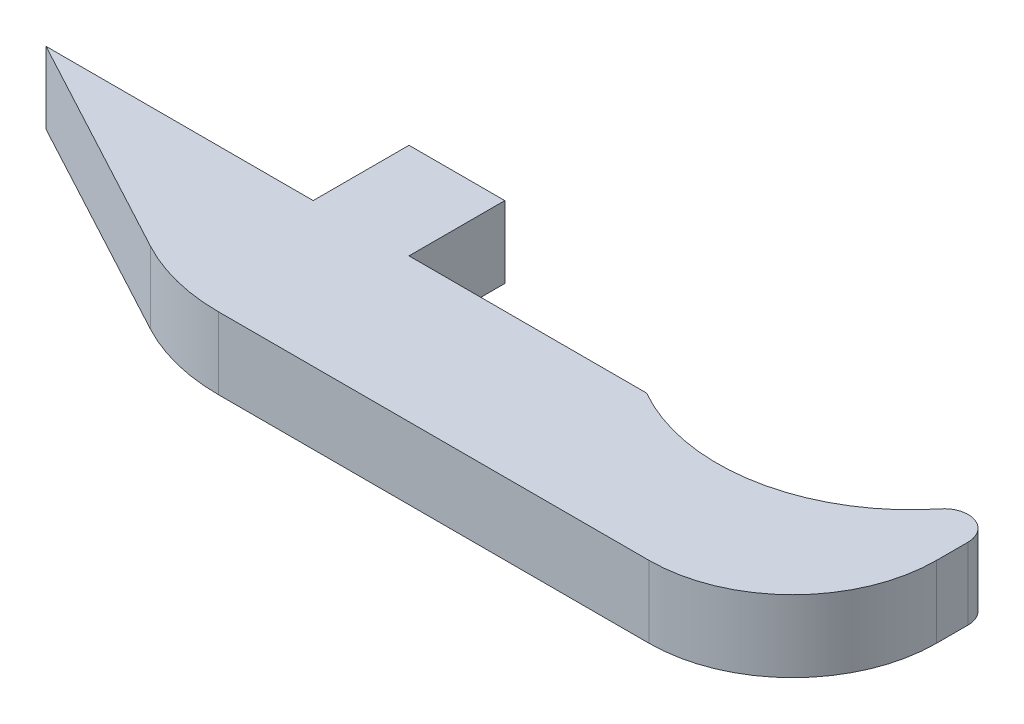
ISO-10303-21;
HEADER;
FILE_DESCRIPTION(('STEP AP214'),'2;1');
FILE_NAME('part.step','',(''),(''),'','','');
FILE_SCHEMA(('AUTOMOTIVE_DESIGN { 1 0 10303 214 1 1 1 1 }'));
ENDSEC;
DATA;
#1=APPLICATION_CONTEXT('core data for automotive mechanical design processes');
#2=APPLICATION_PROTOCOL_DEFINITION('international standard','automotive_design',2000,#1);
#3=PRODUCT_CONTEXT('',#1,'mechanical');
#4=PRODUCT('Part','Part','',(#3));
#5=PRODUCT_RELATED_PRODUCT_CATEGORY('part','',(#4));
#6=PRODUCT_DEFINITION_FORMATION('','',#4);
#7=PRODUCT_DEFINITION_CONTEXT('part definition',#1,'design');
#8=PRODUCT_DEFINITION('design','',#6,#7);
#9=PRODUCT_DEFINITION_SHAPE('','',#8);
#10=(LENGTH_UNIT() NAMED_UNIT(*) SI_UNIT(.MILLI.,.METRE.));
#11=(NAMED_UNIT(*) PLANE_ANGLE_UNIT() SI_UNIT($,.RADIAN.));
#12=(NAMED_UNIT(*) SI_UNIT($,.STERADIAN.) SOLID_ANGLE_UNIT());
#13=UNCERTAINTY_MEASURE_WITH_UNIT(LENGTH_MEASURE(1.E-05),#10,'distance_accuracy_value','');
#14=(GEOMETRIC_REPRESENTATION_CONTEXT(3) GLOBAL_UNCERTAINTY_ASSIGNED_CONTEXT((#13)) GLOBAL_UNIT_ASSIGNED_CONTEXT((#10,
#11,#12)) REPRESENTATION_CONTEXT('',''));
#15=CARTESIAN_POINT('',(0.,0.,0.));
#16=DIRECTION('',(0.,0.,1.));
#17=DIRECTION('',(1.,0.,0.));
#18=AXIS2_PLACEMENT_3D('',#15,#16,#17);
#19=CARTESIAN_POINT('',(0.,4.7625,0.));
#20=DIRECTION('',(0.,0.,1.));
#21=DIRECTION('',(1.,0.,0.));
#22=AXIS2_PLACEMENT_3D('',#19,#20,#21);
#23=PLANE('',#22);
#24=DIRECTION('',(-1.,0.,0.));
#25=VECTOR('',#24,1.);
#26=CARTESIAN_POINT('',(0.,0.,0.));
#27=LINE('',#26,#25);
#28=CARTESIAN_POINT('',(42.9930989263059,0.,0.));
#29=VERTEX_POINT('',#28);
#30=CARTESIAN_POINT('',(27.2395000000001,0.,0.));
#31=VERTEX_POINT('',#30);
#32=EDGE_CURVE('E177',#29,#31,#27,.T.);
#33=ORIENTED_EDGE('',*,*,#32,.T.);
#34=DIRECTION('',(0.,-1.,0.));
#35=VECTOR('',#34,1.);
#36=CARTESIAN_POINT('',(27.2395000000001,4.7625,0.));
#37=LINE('',#36,#35);
#38=CARTESIAN_POINT('',(27.2395000000001,4.7625,0.));
#39=VERTEX_POINT('',#38);
#40=EDGE_CURVE('E58',#39,#31,#37,.T.);
#41=ORIENTED_EDGE('',*,*,#40,.F.);
#42=DIRECTION('',(-1.,0.,0.));
#43=VECTOR('',#42,1.);
#44=CARTESIAN_POINT('',(0.,4.7625,0.));
#45=LINE('',#44,#43);
#46=CARTESIAN_POINT('',(42.9930989263059,4.7625,0.));
#47=VERTEX_POINT('',#46);
#48=EDGE_CURVE('E165',#47,#39,#45,.T.);
#49=ORIENTED_EDGE('',*,*,#48,.F.);
#50=DIRECTION('',(0.,-1.,0.));
#51=VECTOR('',#50,1.);
#52=CARTESIAN_POINT('',(42.9930989263059,4.7625,0.));
#53=LINE('',#52,#51);
#54=EDGE_CURVE('E187',#47,#29,#53,.T.);
#55=ORIENTED_EDGE('',*,*,#54,.T.);
#56=EDGE_LOOP('',(#33,#41,#49,#55));
#57=FACE_BOUND('',#56,.T.);
#58=ADVANCED_FACE('F35',(#57),#23,.F.);
#59=CARTESIAN_POINT('',(49.3775999999999,4.7625,-11.1252));
#60=DIRECTION('',(0.,-1.,0.));
#61=DIRECTION('',(0.,0.,-1.));
#62=AXIS2_PLACEMENT_3D('',#59,#60,#61);
#63=CYLINDRICAL_SURFACE('',#62,12.827);
#64=CARTESIAN_POINT('',(49.3775999999999,4.7625,-11.1252));
#65=DIRECTION('',(0.,1.,0.));
#66=DIRECTION('',(0.,0.,1.));
#67=AXIS2_PLACEMENT_3D('',#64,#65,#66);
#68=CIRCLE('',#67,12.827);
#69=CARTESIAN_POINT('',(59.3792696035242,4.7625,-3.09410205875065));
#70=VERTEX_POINT('',#69);
#71=EDGE_CURVE('E161',#47,#70,#68,.T.);
#72=ORIENTED_EDGE('',*,*,#71,.T.);
#73=DIRECTION('',(0.,-1.,0.));
#74=VECTOR('',#73,1.);
#75=CARTESIAN_POINT('',(59.3792696035242,4.7625,-3.09410205875065));
#76=LINE('',#75,#74);
#77=CARTESIAN_POINT('',(59.3792696035242,0.,-3.09410205875065));
#78=VERTEX_POINT('',#77);
#79=EDGE_CURVE('E201',#70,#78,#76,.T.);
#80=ORIENTED_EDGE('',*,*,#79,.T.);
#81=CARTESIAN_POINT('',(49.3775999999999,0.,-11.1252));
#82=DIRECTION('',(0.,1.,0.));
#83=DIRECTION('',(0.,0.,1.));
#84=AXIS2_PLACEMENT_3D('',#81,#82,#83);
#85=CIRCLE('',#84,12.827);
#86=EDGE_CURVE('E158',#29,#78,#85,.T.);
#87=ORIENTED_EDGE('',*,*,#86,.F.);
#88=ORIENTED_EDGE('',*,*,#54,.F.);
#89=EDGE_LOOP('',(#72,#80,#87,#88));
#90=FACE_BOUND('',#89,.T.);
#91=ADVANCED_FACE('F245',(#90),#63,.F.);
#92=CARTESIAN_POINT('',(20.8895000000001,4.7625,0.));
#93=VERTEX_POINT('',#92);
#94=CARTESIAN_POINT('',(3.17499999999972,4.7625,0.));
#95=VERTEX_POINT('',#94);
#96=EDGE_CURVE('E50',#93,#95,#45,.T.);
#97=ORIENTED_EDGE('',*,*,#96,.F.);
#98=DIRECTION('',(0.,-1.,0.));
#99=VECTOR('',#98,1.);
#100=CARTESIAN_POINT('',(20.8895000000001,4.7625,0.));
#101=LINE('',#100,#99);
#102=CARTESIAN_POINT('',(20.8895000000001,0.,0.));
#103=VERTEX_POINT('',#102);
#104=EDGE_CURVE('E145',#93,#103,#101,.T.);
#105=ORIENTED_EDGE('',*,*,#104,.T.);
#106=CARTESIAN_POINT('',(3.17499999999972,0.,0.));
#107=VERTEX_POINT('',#106);
#108=EDGE_CURVE('E176',#103,#107,#27,.T.);
#109=ORIENTED_EDGE('',*,*,#108,.T.);
#110=DIRECTION('',(0.,-1.,0.));
#111=VECTOR('',#110,1.);
#112=CARTESIAN_POINT('',(3.17499999999972,4.7625,0.));
#113=LINE('',#112,#111);
#114=EDGE_CURVE('E173',#95,#107,#113,.T.);
#115=ORIENTED_EDGE('',*,*,#114,.F.);
#116=EDGE_LOOP('',(#97,#105,#109,#115));
#117=FACE_BOUND('',#116,.T.);
#118=ADVANCED_FACE('F250',(#117),#23,.F.);
#119=CARTESIAN_POINT('',(0.709577123322862,4.7625,-1.32265175787383));
#120=DIRECTION('',(0.472746081675464,0.,-0.881198696243075));
#121=DIRECTION('',(-0.881198696243075,0.,-0.472746081675464));
#122=AXIS2_PLACEMENT_3D('',#119,#120,#121);
#123=PLANE('',#122);
#124=DIRECTION('',(0.881198696243075,0.,0.472746081675464));
#125=VECTOR('',#124,1.);
#126=CARTESIAN_POINT('',(0.709577123322862,0.,-1.32265175787383));
#127=LINE('',#126,#125);
#128=CARTESIAN_POINT('',(18.117240496423,0.,8.01622344228706));
#129=VERTEX_POINT('',#128);
#130=EDGE_CURVE('E179',#107,#129,#127,.T.);
#131=ORIENTED_EDGE('',*,*,#130,.T.);
#132=DIRECTION('',(0.,-1.,0.));
#133=VECTOR('',#132,1.);
#134=CARTESIAN_POINT('',(18.117240496423,4.7625,8.01622344228706));
#135=LINE('',#134,#133);
#136=CARTESIAN_POINT('',(18.117240496423,4.7625,8.01622344228706));
#137=VERTEX_POINT('',#136);
#138=EDGE_CURVE('E43',#129,#137,#135,.F.);
#139=ORIENTED_EDGE('',*,*,#138,.T.);
#140=DIRECTION('',(0.881198696243075,0.,0.472746081675464));
#141=VECTOR('',#140,1.);
#142=CARTESIAN_POINT('',(0.709577123322862,4.7625,-1.32265175787383));
#143=LINE('',#142,#141);
#144=EDGE_CURVE('E167',#95,#137,#143,.T.);
#145=ORIENTED_EDGE('',*,*,#144,.F.);
#146=ORIENTED_EDGE('',*,*,#114,.T.);
#147=EDGE_LOOP('',(#131,#139,#145,#146));
#148=FACE_BOUND('',#147,.T.);
#149=ADVANCED_FACE('F217',(#148),#123,.F.);
#150=CARTESIAN_POINT('',(0.,4.7625,9.525));
#151=DIRECTION('',(0.,0.,-1.));
#152=DIRECTION('',(-1.,0.,0.));
#153=AXIS2_PLACEMENT_3D('',#150,#151,#152);
#154=PLANE('',#153);
#155=DIRECTION('',(1.,0.,0.));
#156=VECTOR('',#155,1.);
#157=CARTESIAN_POINT('',(0.,4.7625,9.525));
#158=LINE('',#157,#156);
#159=CARTESIAN_POINT('',(24.1211157337014,4.7625,9.525));
#160=VERTEX_POINT('',#159);
#161=CARTESIAN_POINT('',(52.6795999999999,4.7625,9.525));
#162=VERTEX_POINT('',#161);
#163=EDGE_CURVE('E169',#160,#162,#158,.T.);
#164=ORIENTED_EDGE('',*,*,#163,.F.);
#165=DIRECTION('',(0.,-1.,0.));
#166=VECTOR('',#165,1.);
#167=CARTESIAN_POINT('',(24.1211157337014,4.7625,9.525));
#168=LINE('',#167,#166);
#169=CARTESIAN_POINT('',(24.1211157337014,0.,9.525));
#170=VERTEX_POINT('',#169);
#171=EDGE_CURVE('E210',#160,#170,#168,.T.);
#172=ORIENTED_EDGE('',*,*,#171,.T.);
#173=DIRECTION('',(1.,0.,0.));
#174=VECTOR('',#173,1.);
#175=CARTESIAN_POINT('',(0.,0.,9.525));
#176=LINE('',#175,#174);
#177=CARTESIAN_POINT('',(52.6795999999999,0.,9.525));
#178=VERTEX_POINT('',#177);
#179=EDGE_CURVE('E182',#170,#178,#176,.T.);
#180=ORIENTED_EDGE('',*,*,#179,.T.);
#181=DIRECTION('',(0.,-1.,0.));
#182=VECTOR('',#181,1.);
#183=CARTESIAN_POINT('',(52.6795999999999,4.7625,9.525));
#184=LINE('',#183,#182);
#185=EDGE_CURVE('E195',#178,#162,#184,.F.);
#186=ORIENTED_EDGE('',*,*,#185,.T.);
#187=EDGE_LOOP('',(#164,#172,#180,#186));
#188=FACE_BOUND('',#187,.T.);
#189=ADVANCED_FACE('F225',(#188),#154,.F.);
#190=CARTESIAN_POINT('',(62.2045999999999,4.7625,0.));
#191=DIRECTION('',(1.,0.,0.));
#192=DIRECTION('',(0.,0.,-1.));
#193=AXIS2_PLACEMENT_3D('',#190,#191,#192);
#194=PLANE('',#193);
#195=DIRECTION('',(0.,0.,1.));
#196=VECTOR('',#195,1.);
#197=CARTESIAN_POINT('',(62.2045999999999,0.,0.));
#198=LINE('',#197,#196);
#199=CARTESIAN_POINT('',(62.2045999999999,0.,-2.10015429374455));
#200=VERTEX_POINT('',#199);
#201=CARTESIAN_POINT('',(62.2045999999999,0.,0.));
#202=VERTEX_POINT('',#201);
#203=EDGE_CURVE('E164',#200,#202,#198,.T.);
#204=ORIENTED_EDGE('',*,*,#203,.F.);
#205=DIRECTION('',(0.,-1.,0.));
#206=VECTOR('',#205,1.);
#207=CARTESIAN_POINT('',(62.2045999999999,4.7625,-2.10015429374455));
#208=LINE('',#207,#206);
#209=CARTESIAN_POINT('',(62.2045999999999,4.7625,-2.10015429374455));
#210=VERTEX_POINT('',#209);
#211=EDGE_CURVE('E206',#200,#210,#208,.F.);
#212=ORIENTED_EDGE('',*,*,#211,.T.);
#213=DIRECTION('',(0.,0.,1.));
#214=VECTOR('',#213,1.);
#215=CARTESIAN_POINT('',(62.2045999999999,4.7625,0.));
#216=LINE('',#215,#214);
#217=CARTESIAN_POINT('',(62.2045999999999,4.7625,0.));
#218=VERTEX_POINT('',#217);
#219=EDGE_CURVE('E171',#210,#218,#216,.T.);
#220=ORIENTED_EDGE('',*,*,#219,.T.);
#221=DIRECTION('',(0.,-1.,0.));
#222=VECTOR('',#221,1.);
#223=CARTESIAN_POINT('',(62.2045999999999,0.,0.));
#224=LINE('',#223,#222);
#225=EDGE_CURVE('E189',#218,#202,#224,.T.);
#226=ORIENTED_EDGE('',*,*,#225,.T.);
#227=EDGE_LOOP('',(#204,#212,#220,#226));
#228=FACE_BOUND('',#227,.T.);
#229=ADVANCED_FACE('F277',(#228),#194,.T.);
#230=CARTESIAN_POINT('',(0.,4.7625,0.));
#231=DIRECTION('',(0.,1.,0.));
#232=DIRECTION('',(0.,0.,1.));
#233=AXIS2_PLACEMENT_3D('',#230,#231,#232);
#234=PLANE('',#233);
#235=ORIENTED_EDGE('',*,*,#144,.T.);
#236=CARTESIAN_POINT('',(24.1211157337014,4.7625,-3.175));
#237=DIRECTION('',(0.,1.,0.));
#238=DIRECTION('',(0.,0.,1.));
#239=AXIS2_PLACEMENT_3D('',#236,#237,#238);
#240=CIRCLE('',#239,12.7);
#241=EDGE_CURVE('E11',#137,#160,#240,.T.);
#242=ORIENTED_EDGE('',*,*,#241,.T.);
#243=ORIENTED_EDGE('',*,*,#163,.T.);
#244=CARTESIAN_POINT('',(52.6795999999999,4.7625,0.));
#245=DIRECTION('',(0.,1.,0.));
#246=DIRECTION('',(0.,0.,1.));
#247=AXIS2_PLACEMENT_3D('',#244,#245,#246);
#248=CIRCLE('',#247,9.525);
#249=EDGE_CURVE('E198',#162,#218,#248,.T.);
#250=ORIENTED_EDGE('',*,*,#249,.T.);
#251=ORIENTED_EDGE('',*,*,#219,.F.);
#252=CARTESIAN_POINT('',(60.6170999999999,4.7625,-2.10015429374455));
#253=DIRECTION('',(0.,1.,0.));
#254=DIRECTION('',(0.,0.,1.));
#255=AXIS2_PLACEMENT_3D('',#252,#253,#254);
#256=CIRCLE('',#255,1.5875);
#257=EDGE_CURVE('E208',#210,#70,#256,.T.);
#258=ORIENTED_EDGE('',*,*,#257,.T.);
#259=ORIENTED_EDGE('',*,*,#71,.F.);
#260=ORIENTED_EDGE('',*,*,#48,.T.);
#261=DIRECTION('',(0.,0.,1.));
#262=VECTOR('',#261,1.);
#263=CARTESIAN_POINT('',(27.2395000000001,4.7625,0.));
#264=LINE('',#263,#262);
#265=CARTESIAN_POINT('',(27.2395000000001,4.7625,-6.35));
#266=VERTEX_POINT('',#265);
#267=EDGE_CURVE('E133',#266,#39,#264,.T.);
#268=ORIENTED_EDGE('',*,*,#267,.F.);
#269=DIRECTION('',(-1.,0.,0.));
#270=VECTOR('',#269,1.);
#271=CARTESIAN_POINT('',(0.,4.7625,-6.35));
#272=LINE('',#271,#270);
#273=CARTESIAN_POINT('',(20.8895000000001,4.7625,-6.35));
#274=VERTEX_POINT('',#273);
#275=EDGE_CURVE('E126',#266,#274,#272,.T.);
#276=ORIENTED_EDGE('',*,*,#275,.T.);
#277=DIRECTION('',(0.,0.,-1.));
#278=VECTOR('',#277,1.);
#279=CARTESIAN_POINT('',(20.8895000000001,4.7625,0.));
#280=LINE('',#279,#278);
#281=EDGE_CURVE('E131',#93,#274,#280,.T.);
#282=ORIENTED_EDGE('',*,*,#281,.F.);
#283=ORIENTED_EDGE('',*,*,#96,.T.);
#284=EDGE_LOOP('',(#235,#242,#243,#250,#251,#258,#259,#260,#268,#276,#282,#283));
#285=FACE_BOUND('',#284,.T.);
#286=ADVANCED_FACE('F129',(#285),#234,.T.);
#287=CARTESIAN_POINT('',(0.,0.,0.));
#288=DIRECTION('',(0.,1.,0.));
#289=DIRECTION('',(0.,0.,1.));
#290=AXIS2_PLACEMENT_3D('',#287,#288,#289);
#291=PLANE('',#290);
#292=ORIENTED_EDGE('',*,*,#179,.F.);
#293=CARTESIAN_POINT('',(24.1211157337014,0.,-3.175));
#294=DIRECTION('',(0.,1.,0.));
#295=DIRECTION('',(0.,0.,1.));
#296=AXIS2_PLACEMENT_3D('',#293,#294,#295);
#297=CIRCLE('',#296,12.7);
#298=EDGE_CURVE('E213',#170,#129,#297,.F.);
#299=ORIENTED_EDGE('',*,*,#298,.T.);
#300=ORIENTED_EDGE('',*,*,#130,.F.);
#301=ORIENTED_EDGE('',*,*,#108,.F.);
#302=DIRECTION('',(0.,0.,-1.));
#303=VECTOR('',#302,1.);
#304=CARTESIAN_POINT('',(20.8895000000001,0.,0.));
#305=LINE('',#304,#303);
#306=CARTESIAN_POINT('',(20.8895000000001,0.,-6.35));
#307=VERTEX_POINT('',#306);
#308=EDGE_CURVE('E154',#103,#307,#305,.T.);
#309=ORIENTED_EDGE('',*,*,#308,.T.);
#310=DIRECTION('',(-1.,0.,0.));
#311=VECTOR('',#310,1.);
#312=CARTESIAN_POINT('',(0.,0.,-6.35));
#313=LINE('',#312,#311);
#314=CARTESIAN_POINT('',(27.2395000000001,0.,-6.35));
#315=VERTEX_POINT('',#314);
#316=EDGE_CURVE('E140',#315,#307,#313,.T.);
#317=ORIENTED_EDGE('',*,*,#316,.F.);
#318=DIRECTION('',(0.,0.,1.));
#319=VECTOR('',#318,1.);
#320=CARTESIAN_POINT('',(27.2395000000001,0.,0.));
#321=LINE('',#320,#319);
#322=EDGE_CURVE('E148',#315,#31,#321,.T.);
#323=ORIENTED_EDGE('',*,*,#322,.T.);
#324=ORIENTED_EDGE('',*,*,#32,.F.);
#325=ORIENTED_EDGE('',*,*,#86,.T.);
#326=CARTESIAN_POINT('',(60.6170999999999,0.,-2.10015429374455));
#327=DIRECTION('',(0.,1.,0.));
#328=DIRECTION('',(0.,0.,1.));
#329=AXIS2_PLACEMENT_3D('',#326,#327,#328);
#330=CIRCLE('',#329,1.5875);
#331=EDGE_CURVE('E204',#78,#200,#330,.F.);
#332=ORIENTED_EDGE('',*,*,#331,.T.);
#333=ORIENTED_EDGE('',*,*,#203,.T.);
#334=CARTESIAN_POINT('',(52.6795999999999,0.,0.));
#335=DIRECTION('',(0.,1.,0.));
#336=DIRECTION('',(0.,0.,1.));
#337=AXIS2_PLACEMENT_3D('',#334,#335,#336);
#338=CIRCLE('',#337,9.525);
#339=EDGE_CURVE('E192',#202,#178,#338,.F.);
#340=ORIENTED_EDGE('',*,*,#339,.T.);
#341=EDGE_LOOP('',(#292,#299,#300,#301,#309,#317,#323,#324,#325,#332,#333,#340));
#342=FACE_BOUND('',#341,.T.);
#343=ADVANCED_FACE('F227',(#342),#291,.F.);
#344=CARTESIAN_POINT('',(52.6795999999999,4.7625,0.));
#345=DIRECTION('',(0.,1.,0.));
#346=DIRECTION('',(0.,0.,1.));
#347=AXIS2_PLACEMENT_3D('',#344,#345,#346);
#348=CYLINDRICAL_SURFACE('',#347,9.525);
#349=ORIENTED_EDGE('',*,*,#249,.F.);
#350=ORIENTED_EDGE('',*,*,#185,.F.);
#351=ORIENTED_EDGE('',*,*,#339,.F.);
#352=ORIENTED_EDGE('',*,*,#225,.F.);
#353=EDGE_LOOP('',(#349,#350,#351,#352));
#354=FACE_BOUND('',#353,.T.);
#355=ADVANCED_FACE('F234',(#354),#348,.T.);
#356=CARTESIAN_POINT('',(60.6170999999999,4.7625,-2.10015429374455));
#357=DIRECTION('',(0.,-1.,0.));
#358=DIRECTION('',(0.,0.,-1.));
#359=AXIS2_PLACEMENT_3D('',#356,#357,#358);
#360=CYLINDRICAL_SURFACE('',#359,1.5875);
#361=ORIENTED_EDGE('',*,*,#257,.F.);
#362=ORIENTED_EDGE('',*,*,#211,.F.);
#363=ORIENTED_EDGE('',*,*,#331,.F.);
#364=ORIENTED_EDGE('',*,*,#79,.F.);
#365=EDGE_LOOP('',(#361,#362,#363,#364));
#366=FACE_BOUND('',#365,.T.);
#367=ADVANCED_FACE('F242',(#366),#360,.T.);
#368=CARTESIAN_POINT('',(24.1211157337014,4.7625,-3.175));
#369=DIRECTION('',(0.,-1.,0.));
#370=DIRECTION('',(0.,0.,-1.));
#371=AXIS2_PLACEMENT_3D('',#368,#369,#370);
#372=CYLINDRICAL_SURFACE('',#371,12.7);
#373=ORIENTED_EDGE('',*,*,#241,.F.);
#374=ORIENTED_EDGE('',*,*,#138,.F.);
#375=ORIENTED_EDGE('',*,*,#298,.F.);
#376=ORIENTED_EDGE('',*,*,#171,.F.);
#377=EDGE_LOOP('',(#373,#374,#375,#376));
#378=FACE_BOUND('',#377,.T.);
#379=ADVANCED_FACE('F37',(#378),#372,.T.);
#380=CARTESIAN_POINT('',(27.2395000000001,4.7625,0.));
#381=DIRECTION('',(1.,0.,0.));
#382=DIRECTION('',(0.,0.,-1.));
#383=AXIS2_PLACEMENT_3D('',#380,#381,#382);
#384=PLANE('',#383);
#385=ORIENTED_EDGE('',*,*,#322,.F.);
#386=DIRECTION('',(0.,-1.,0.));
#387=VECTOR('',#386,1.);
#388=CARTESIAN_POINT('',(27.2395000000001,4.7625,-6.35));
#389=LINE('',#388,#387);
#390=EDGE_CURVE('E144',#266,#315,#389,.T.);
#391=ORIENTED_EDGE('',*,*,#390,.F.);
#392=ORIENTED_EDGE('',*,*,#267,.T.);
#393=ORIENTED_EDGE('',*,*,#40,.T.);
#394=EDGE_LOOP('',(#385,#391,#392,#393));
#395=FACE_BOUND('',#394,.T.);
#396=ADVANCED_FACE('F249',(#395),#384,.T.);
#397=CARTESIAN_POINT('',(0.,4.7625,-6.35));
#398=DIRECTION('',(0.,0.,1.));
#399=DIRECTION('',(1.,0.,0.));
#400=AXIS2_PLACEMENT_3D('',#397,#398,#399);
#401=PLANE('',#400);
#402=ORIENTED_EDGE('',*,*,#316,.T.);
#403=DIRECTION('',(0.,-1.,0.));
#404=VECTOR('',#403,1.);
#405=CARTESIAN_POINT('',(20.8895000000001,4.7625,-6.35));
#406=LINE('',#405,#404);
#407=EDGE_CURVE('E137',#274,#307,#406,.T.);
#408=ORIENTED_EDGE('',*,*,#407,.F.);
#409=ORIENTED_EDGE('',*,*,#275,.F.);
#410=ORIENTED_EDGE('',*,*,#390,.T.);
#411=EDGE_LOOP('',(#402,#408,#409,#410));
#412=FACE_BOUND('',#411,.T.);
#413=ADVANCED_FACE('F138',(#412),#401,.F.);
#414=CARTESIAN_POINT('',(20.8895000000001,4.7625,0.));
#415=DIRECTION('',(-1.,0.,0.));
#416=DIRECTION('',(0.,0.,1.));
#417=AXIS2_PLACEMENT_3D('',#414,#415,#416);
#418=PLANE('',#417);
#419=ORIENTED_EDGE('',*,*,#308,.F.);
#420=ORIENTED_EDGE('',*,*,#104,.F.);
#421=ORIENTED_EDGE('',*,*,#281,.T.);
#422=ORIENTED_EDGE('',*,*,#407,.T.);
#423=EDGE_LOOP('',(#419,#420,#421,#422));
#424=FACE_BOUND('',#423,.T.);
#425=ADVANCED_FACE('F147',(#424),#418,.T.);
#426=CLOSED_SHELL('',(#58,#91,#118,#149,#189,#229,#286,#343,#355,#367,#379,#396,#413,#425));
#427=MANIFOLD_SOLID_BREP('B2',#426);
#428=ADVANCED_BREP_SHAPE_REPRESENTATION('',(#18,#427),#14);
#429=SHAPE_DEFINITION_REPRESENTATION(#9,#428);
ENDSEC;
END-ISO-10303-21;
